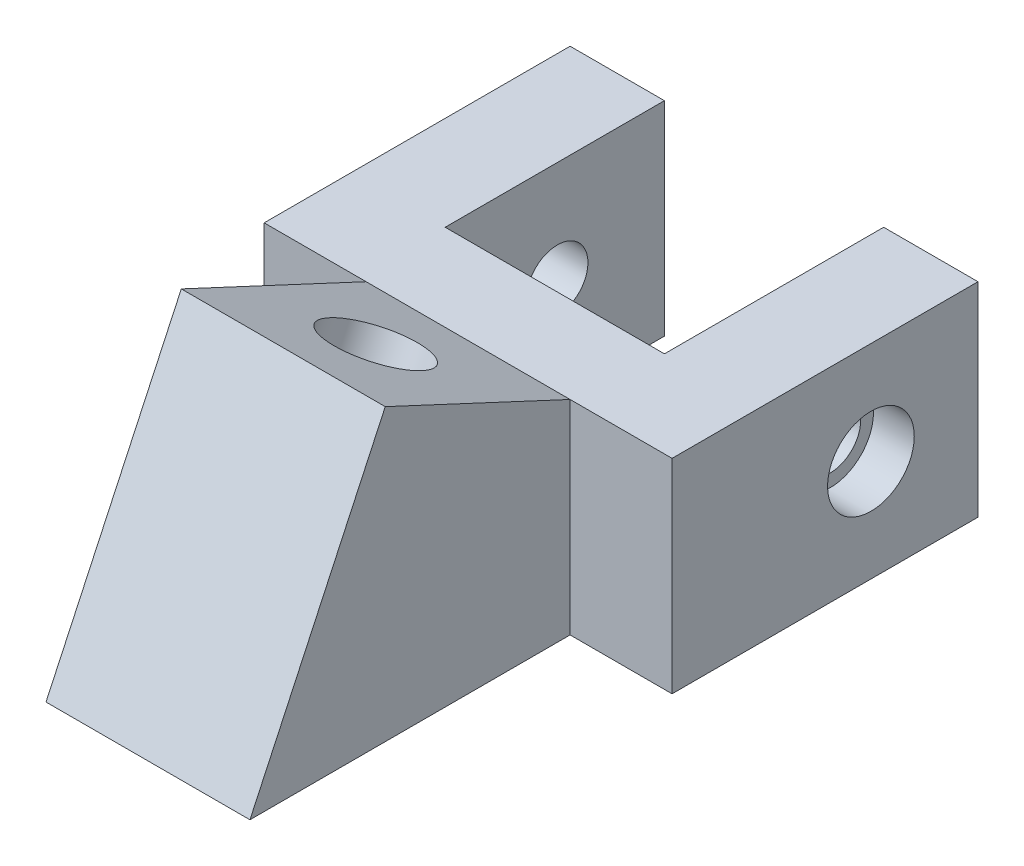
ISO-10303-21;
HEADER;
FILE_DESCRIPTION(('STEP AP214'),'2;1');
FILE_NAME('part.step','',(''),(''),'','','');
FILE_SCHEMA(('AUTOMOTIVE_DESIGN { 1 0 10303 214 1 1 1 1 }'));
ENDSEC;
DATA;
#1=APPLICATION_CONTEXT('core data for automotive mechanical design processes');
#2=APPLICATION_PROTOCOL_DEFINITION('international standard','automotive_design',2000,#1);
#3=PRODUCT_CONTEXT('',#1,'mechanical');
#4=PRODUCT('Part','Part','',(#3));
#5=PRODUCT_RELATED_PRODUCT_CATEGORY('part','',(#4));
#6=PRODUCT_DEFINITION_FORMATION('','',#4);
#7=PRODUCT_DEFINITION_CONTEXT('part definition',#1,'design');
#8=PRODUCT_DEFINITION('design','',#6,#7);
#9=PRODUCT_DEFINITION_SHAPE('','',#8);
#10=(LENGTH_UNIT() NAMED_UNIT(*) SI_UNIT(.MILLI.,.METRE.));
#11=(NAMED_UNIT(*) PLANE_ANGLE_UNIT() SI_UNIT($,.RADIAN.));
#12=(NAMED_UNIT(*) SI_UNIT($,.STERADIAN.) SOLID_ANGLE_UNIT());
#13=UNCERTAINTY_MEASURE_WITH_UNIT(LENGTH_MEASURE(1.E-05),#10,'distance_accuracy_value','');
#14=(GEOMETRIC_REPRESENTATION_CONTEXT(3) GLOBAL_UNCERTAINTY_ASSIGNED_CONTEXT((#13)) GLOBAL_UNIT_ASSIGNED_CONTEXT((#10,
#11,#12)) REPRESENTATION_CONTEXT('',''));
#15=CARTESIAN_POINT('',(0.,0.,0.));
#16=DIRECTION('',(0.,0.,1.));
#17=DIRECTION('',(1.,0.,0.));
#18=AXIS2_PLACEMENT_3D('',#15,#16,#17);
#19=CARTESIAN_POINT('',(-20.,10.,-4.5));
#20=DIRECTION('',(1.,0.,0.));
#21=DIRECTION('',(0.,0.,-1.));
#22=AXIS2_PLACEMENT_3D('',#19,#20,#21);
#23=CYLINDRICAL_SURFACE('',#22,3.);
#24=CARTESIAN_POINT('',(-10.75,10.,-4.5));
#25=DIRECTION('',(1.,0.,0.));
#26=DIRECTION('',(0.,0.,-1.));
#27=AXIS2_PLACEMENT_3D('',#24,#25,#26);
#28=CIRCLE('',#27,3.);
#29=CARTESIAN_POINT('',(-10.75,10.,-7.5));
#30=VERTEX_POINT('',#29);
#31=EDGE_CURVE('E184',#30,#30,#28,.T.);
#32=ORIENTED_EDGE('',*,*,#31,.T.);
#33=EDGE_LOOP('',(#32));
#34=FACE_BOUND('',#33,.T.);
#35=CARTESIAN_POINT('',(-16.,10.,-4.5));
#36=DIRECTION('',(-1.,0.,0.));
#37=DIRECTION('',(0.,0.,1.));
#38=AXIS2_PLACEMENT_3D('',#35,#36,#37);
#39=CIRCLE('',#38,3.);
#40=CARTESIAN_POINT('',(-16.,10.,-1.49999999999999));
#41=VERTEX_POINT('',#40);
#42=EDGE_CURVE('E37',#41,#41,#39,.F.);
#43=ORIENTED_EDGE('',*,*,#42,.F.);
#44=EDGE_LOOP('',(#43));
#45=FACE_BOUND('',#44,.T.);
#46=ADVANCED_FACE('F33',(#34,#45),#23,.F.);
#47=CARTESIAN_POINT('',(10.75,10.,-4.5));
#48=DIRECTION('',(-1.,0.,0.));
#49=DIRECTION('',(0.,0.,1.));
#50=AXIS2_PLACEMENT_3D('',#47,#48,#49);
#51=CIRCLE('',#50,3.);
#52=CARTESIAN_POINT('',(10.75,10.,-1.49999999999999));
#53=VERTEX_POINT('',#52);
#54=EDGE_CURVE('E187',#53,#53,#51,.T.);
#55=ORIENTED_EDGE('',*,*,#54,.T.);
#56=EDGE_LOOP('',(#55));
#57=FACE_BOUND('',#56,.T.);
#58=CARTESIAN_POINT('',(16.,10.,-4.5));
#59=DIRECTION('',(1.,0.,0.));
#60=DIRECTION('',(0.,0.,-1.));
#61=AXIS2_PLACEMENT_3D('',#58,#59,#60);
#62=CIRCLE('',#61,3.);
#63=CARTESIAN_POINT('',(16.,10.,-7.5));
#64=VERTEX_POINT('',#63);
#65=EDGE_CURVE('E316',#64,#64,#62,.F.);
#66=ORIENTED_EDGE('',*,*,#65,.F.);
#67=EDGE_LOOP('',(#66));
#68=FACE_BOUND('',#67,.T.);
#69=ADVANCED_FACE('F341',(#57,#68),#23,.F.);
#70=CARTESIAN_POINT('',(-20.,20.,15.));
#71=DIRECTION('',(0.,0.,-1.));
#72=DIRECTION('',(-1.,0.,0.));
#73=AXIS2_PLACEMENT_3D('',#70,#71,#72);
#74=PLANE('',#73);
#75=DIRECTION('',(0.,-1.,0.));
#76=VECTOR('',#75,1.);
#77=CARTESIAN_POINT('',(-10.,20.,15.));
#78=LINE('',#77,#76);
#79=CARTESIAN_POINT('',(-10.,20.,15.));
#80=VERTEX_POINT('',#79);
#81=CARTESIAN_POINT('',(-10.,0.,15.));
#82=VERTEX_POINT('',#81);
#83=EDGE_CURVE('E211',#80,#82,#78,.T.);
#84=ORIENTED_EDGE('',*,*,#83,.F.);
#85=DIRECTION('',(1.,0.,0.));
#86=VECTOR('',#85,1.);
#87=CARTESIAN_POINT('',(-20.,20.,15.));
#88=LINE('',#87,#86);
#89=CARTESIAN_POINT('',(-20.,20.,15.));
#90=VERTEX_POINT('',#89);
#91=EDGE_CURVE('E252',#90,#80,#88,.T.);
#92=ORIENTED_EDGE('',*,*,#91,.F.);
#93=DIRECTION('',(0.,-1.,0.));
#94=VECTOR('',#93,1.);
#95=CARTESIAN_POINT('',(-20.,20.,15.));
#96=LINE('',#95,#94);
#97=CARTESIAN_POINT('',(-20.,0.,15.));
#98=VERTEX_POINT('',#97);
#99=EDGE_CURVE('E289',#90,#98,#96,.T.);
#100=ORIENTED_EDGE('',*,*,#99,.T.);
#101=DIRECTION('',(1.,0.,0.));
#102=VECTOR('',#101,1.);
#103=CARTESIAN_POINT('',(-20.,0.,15.));
#104=LINE('',#103,#102);
#105=EDGE_CURVE('E277',#98,#82,#104,.T.);
#106=ORIENTED_EDGE('',*,*,#105,.T.);
#107=EDGE_LOOP('',(#84,#92,#100,#106));
#108=FACE_BOUND('',#107,.T.);
#109=ADVANCED_FACE('F347',(#108),#74,.F.);
#110=CARTESIAN_POINT('',(-10.75,20.,-15.));
#111=DIRECTION('',(1.,0.,0.));
#112=DIRECTION('',(0.,0.,-1.));
#113=AXIS2_PLACEMENT_3D('',#110,#111,#112);
#114=PLANE('',#113);
#115=ORIENTED_EDGE('',*,*,#31,.F.);
#116=EDGE_LOOP('',(#115));
#117=FACE_BOUND('',#116,.T.);
#118=DIRECTION('',(0.,0.,1.));
#119=VECTOR('',#118,1.);
#120=CARTESIAN_POINT('',(-10.75,0.,-15.));
#121=LINE('',#120,#119);
#122=CARTESIAN_POINT('',(-10.75,0.,-15.));
#123=VERTEX_POINT('',#122);
#124=CARTESIAN_POINT('',(-10.75,0.,6.5));
#125=VERTEX_POINT('',#124);
#126=EDGE_CURVE('E230',#123,#125,#121,.T.);
#127=ORIENTED_EDGE('',*,*,#126,.F.);
#128=DIRECTION('',(0.,-1.,0.));
#129=VECTOR('',#128,1.);
#130=CARTESIAN_POINT('',(-10.75,20.,-15.));
#131=LINE('',#130,#129);
#132=CARTESIAN_POINT('',(-10.75,20.,-15.));
#133=VERTEX_POINT('',#132);
#134=EDGE_CURVE('E285',#133,#123,#131,.T.);
#135=ORIENTED_EDGE('',*,*,#134,.F.);
#136=DIRECTION('',(0.,0.,1.));
#137=VECTOR('',#136,1.);
#138=CARTESIAN_POINT('',(-10.75,20.,-15.));
#139=LINE('',#138,#137);
#140=CARTESIAN_POINT('',(-10.75,20.,6.5));
#141=VERTEX_POINT('',#140);
#142=EDGE_CURVE('E236',#133,#141,#139,.T.);
#143=ORIENTED_EDGE('',*,*,#142,.T.);
#144=DIRECTION('',(0.,-1.,0.));
#145=VECTOR('',#144,1.);
#146=CARTESIAN_POINT('',(-10.75,20.,6.5));
#147=LINE('',#146,#145);
#148=EDGE_CURVE('E261',#141,#125,#147,.T.);
#149=ORIENTED_EDGE('',*,*,#148,.T.);
#150=EDGE_LOOP('',(#127,#135,#143,#149));
#151=FACE_BOUND('',#150,.T.);
#152=ADVANCED_FACE('F35',(#117,#151),#114,.T.);
#153=CARTESIAN_POINT('',(-20.,20.,-15.));
#154=DIRECTION('',(0.,0.,-1.));
#155=DIRECTION('',(-1.,0.,0.));
#156=AXIS2_PLACEMENT_3D('',#153,#154,#155);
#157=PLANE('',#156);
#158=DIRECTION('',(1.,0.,0.));
#159=VECTOR('',#158,1.);
#160=CARTESIAN_POINT('',(-20.,0.,-15.));
#161=LINE('',#160,#159);
#162=CARTESIAN_POINT('',(-20.,0.,-15.));
#163=VERTEX_POINT('',#162);
#164=EDGE_CURVE('E240',#163,#123,#161,.T.);
#165=ORIENTED_EDGE('',*,*,#164,.F.);
#166=DIRECTION('',(0.,-1.,0.));
#167=VECTOR('',#166,1.);
#168=CARTESIAN_POINT('',(-20.,20.,-15.));
#169=LINE('',#168,#167);
#170=CARTESIAN_POINT('',(-20.,20.,-15.));
#171=VERTEX_POINT('',#170);
#172=EDGE_CURVE('E287',#171,#163,#169,.T.);
#173=ORIENTED_EDGE('',*,*,#172,.F.);
#174=DIRECTION('',(1.,0.,0.));
#175=VECTOR('',#174,1.);
#176=CARTESIAN_POINT('',(-20.,20.,-15.));
#177=LINE('',#176,#175);
#178=EDGE_CURVE('E258',#171,#133,#177,.T.);
#179=ORIENTED_EDGE('',*,*,#178,.T.);
#180=ORIENTED_EDGE('',*,*,#134,.T.);
#181=EDGE_LOOP('',(#165,#173,#179,#180));
#182=FACE_BOUND('',#181,.T.);
#183=ADVANCED_FACE('F404',(#182),#157,.T.);
#184=CARTESIAN_POINT('',(-20.,20.,15.));
#185=DIRECTION('',(-1.,0.,0.));
#186=DIRECTION('',(0.,0.,1.));
#187=AXIS2_PLACEMENT_3D('',#184,#185,#186);
#188=PLANE('',#187);
#189=CARTESIAN_POINT('',(-20.,10.,-4.5));
#190=DIRECTION('',(-1.,0.,0.));
#191=DIRECTION('',(0.,0.,1.));
#192=AXIS2_PLACEMENT_3D('',#189,#190,#191);
#193=CIRCLE('',#192,4.25);
#194=CARTESIAN_POINT('',(-20.,10.,-0.249999999999996));
#195=VERTEX_POINT('',#194);
#196=EDGE_CURVE('E328',#195,#195,#193,.T.);
#197=ORIENTED_EDGE('',*,*,#196,.F.);
#198=EDGE_LOOP('',(#197));
#199=FACE_BOUND('',#198,.T.);
#200=DIRECTION('',(0.,0.,-1.));
#201=VECTOR('',#200,1.);
#202=CARTESIAN_POINT('',(-20.,0.,15.));
#203=LINE('',#202,#201);
#204=EDGE_CURVE('E280',#98,#163,#203,.T.);
#205=ORIENTED_EDGE('',*,*,#204,.F.);
#206=ORIENTED_EDGE('',*,*,#99,.F.);
#207=DIRECTION('',(0.,0.,-1.));
#208=VECTOR('',#207,1.);
#209=CARTESIAN_POINT('',(-20.,20.,15.));
#210=LINE('',#209,#208);
#211=EDGE_CURVE('E255',#90,#171,#210,.T.);
#212=ORIENTED_EDGE('',*,*,#211,.T.);
#213=ORIENTED_EDGE('',*,*,#172,.T.);
#214=EDGE_LOOP('',(#205,#206,#212,#213));
#215=FACE_BOUND('',#214,.T.);
#216=ADVANCED_FACE('F407',(#199,#215),#188,.T.);
#217=CARTESIAN_POINT('',(10.,20.,15.));
#218=VERTEX_POINT('',#217);
#219=CARTESIAN_POINT('',(20.,20.,15.));
#220=VERTEX_POINT('',#219);
#221=EDGE_CURVE('E251',#218,#220,#88,.T.);
#222=ORIENTED_EDGE('',*,*,#221,.F.);
#223=DIRECTION('',(0.,-1.,0.));
#224=VECTOR('',#223,1.);
#225=CARTESIAN_POINT('',(10.,20.,15.));
#226=LINE('',#225,#224);
#227=CARTESIAN_POINT('',(10.,0.,15.));
#228=VERTEX_POINT('',#227);
#229=EDGE_CURVE('E212',#218,#228,#226,.T.);
#230=ORIENTED_EDGE('',*,*,#229,.T.);
#231=CARTESIAN_POINT('',(20.,0.,15.));
#232=VERTEX_POINT('',#231);
#233=EDGE_CURVE('E276',#228,#232,#104,.T.);
#234=ORIENTED_EDGE('',*,*,#233,.T.);
#235=DIRECTION('',(0.,-1.,0.));
#236=VECTOR('',#235,1.);
#237=CARTESIAN_POINT('',(20.,20.,15.));
#238=LINE('',#237,#236);
#239=EDGE_CURVE('E291',#220,#232,#238,.T.);
#240=ORIENTED_EDGE('',*,*,#239,.F.);
#241=EDGE_LOOP('',(#222,#230,#234,#240));
#242=FACE_BOUND('',#241,.T.);
#243=ADVANCED_FACE('F411',(#242),#74,.F.);
#244=CARTESIAN_POINT('',(20.,20.,15.));
#245=DIRECTION('',(-1.,0.,0.));
#246=DIRECTION('',(0.,0.,1.));
#247=AXIS2_PLACEMENT_3D('',#244,#245,#246);
#248=PLANE('',#247);
#249=CARTESIAN_POINT('',(20.,10.,-4.5));
#250=DIRECTION('',(1.,0.,0.));
#251=DIRECTION('',(0.,0.,-1.));
#252=AXIS2_PLACEMENT_3D('',#249,#250,#251);
#253=CIRCLE('',#252,4.25);
#254=CARTESIAN_POINT('',(20.,10.,-8.75));
#255=VERTEX_POINT('',#254);
#256=EDGE_CURVE('E322',#255,#255,#253,.T.);
#257=ORIENTED_EDGE('',*,*,#256,.F.);
#258=EDGE_LOOP('',(#257));
#259=FACE_BOUND('',#258,.T.);
#260=DIRECTION('',(0.,0.,-1.));
#261=VECTOR('',#260,1.);
#262=CARTESIAN_POINT('',(20.,0.,15.));
#263=LINE('',#262,#261);
#264=CARTESIAN_POINT('',(20.,0.,-15.));
#265=VERTEX_POINT('',#264);
#266=EDGE_CURVE('E273',#232,#265,#263,.T.);
#267=ORIENTED_EDGE('',*,*,#266,.T.);
#268=DIRECTION('',(0.,-1.,0.));
#269=VECTOR('',#268,1.);
#270=CARTESIAN_POINT('',(20.,20.,-15.));
#271=LINE('',#270,#269);
#272=CARTESIAN_POINT('',(20.,20.,-15.));
#273=VERTEX_POINT('',#272);
#274=EDGE_CURVE('E294',#273,#265,#271,.T.);
#275=ORIENTED_EDGE('',*,*,#274,.F.);
#276=DIRECTION('',(0.,0.,-1.));
#277=VECTOR('',#276,1.);
#278=CARTESIAN_POINT('',(20.,20.,15.));
#279=LINE('',#278,#277);
#280=EDGE_CURVE('E249',#220,#273,#279,.T.);
#281=ORIENTED_EDGE('',*,*,#280,.F.);
#282=ORIENTED_EDGE('',*,*,#239,.T.);
#283=EDGE_LOOP('',(#267,#275,#281,#282));
#284=FACE_BOUND('',#283,.T.);
#285=ADVANCED_FACE('F415',(#259,#284),#248,.F.);
#286=CARTESIAN_POINT('',(10.75,20.,-15.));
#287=DIRECTION('',(0.,0.,-1.));
#288=DIRECTION('',(-1.,0.,0.));
#289=AXIS2_PLACEMENT_3D('',#286,#287,#288);
#290=PLANE('',#289);
#291=DIRECTION('',(1.,0.,0.));
#292=VECTOR('',#291,1.);
#293=CARTESIAN_POINT('',(10.75,0.,-15.));
#294=LINE('',#293,#292);
#295=CARTESIAN_POINT('',(10.75,0.,-15.));
#296=VERTEX_POINT('',#295);
#297=EDGE_CURVE('E270',#296,#265,#294,.T.);
#298=ORIENTED_EDGE('',*,*,#297,.F.);
#299=DIRECTION('',(0.,-1.,0.));
#300=VECTOR('',#299,1.);
#301=CARTESIAN_POINT('',(10.75,20.,-15.));
#302=LINE('',#301,#300);
#303=CARTESIAN_POINT('',(10.75,20.,-15.));
#304=VERTEX_POINT('',#303);
#305=EDGE_CURVE('E296',#304,#296,#302,.T.);
#306=ORIENTED_EDGE('',*,*,#305,.F.);
#307=DIRECTION('',(1.,0.,0.));
#308=VECTOR('',#307,1.);
#309=CARTESIAN_POINT('',(10.75,20.,-15.));
#310=LINE('',#309,#308);
#311=EDGE_CURVE('E246',#304,#273,#310,.T.);
#312=ORIENTED_EDGE('',*,*,#311,.T.);
#313=ORIENTED_EDGE('',*,*,#274,.T.);
#314=EDGE_LOOP('',(#298,#306,#312,#313));
#315=FACE_BOUND('',#314,.T.);
#316=ADVANCED_FACE('F419',(#315),#290,.T.);
#317=CARTESIAN_POINT('',(10.75,20.,6.5));
#318=DIRECTION('',(-1.,0.,0.));
#319=DIRECTION('',(0.,0.,1.));
#320=AXIS2_PLACEMENT_3D('',#317,#318,#319);
#321=PLANE('',#320);
#322=ORIENTED_EDGE('',*,*,#54,.F.);
#323=EDGE_LOOP('',(#322));
#324=FACE_BOUND('',#323,.T.);
#325=DIRECTION('',(0.,0.,-1.));
#326=VECTOR('',#325,1.);
#327=CARTESIAN_POINT('',(10.75,0.,6.5));
#328=LINE('',#327,#326);
#329=CARTESIAN_POINT('',(10.75,0.,6.5));
#330=VERTEX_POINT('',#329);
#331=EDGE_CURVE('E267',#330,#296,#328,.T.);
#332=ORIENTED_EDGE('',*,*,#331,.F.);
#333=DIRECTION('',(0.,-1.,0.));
#334=VECTOR('',#333,1.);
#335=CARTESIAN_POINT('',(10.75,20.,6.5));
#336=LINE('',#335,#334);
#337=CARTESIAN_POINT('',(10.75,20.,6.5));
#338=VERTEX_POINT('',#337);
#339=EDGE_CURVE('E298',#338,#330,#336,.T.);
#340=ORIENTED_EDGE('',*,*,#339,.F.);
#341=DIRECTION('',(0.,0.,-1.));
#342=VECTOR('',#341,1.);
#343=CARTESIAN_POINT('',(10.75,20.,6.5));
#344=LINE('',#343,#342);
#345=EDGE_CURVE('E243',#338,#304,#344,.T.);
#346=ORIENTED_EDGE('',*,*,#345,.T.);
#347=ORIENTED_EDGE('',*,*,#305,.T.);
#348=EDGE_LOOP('',(#332,#340,#346,#347));
#349=FACE_BOUND('',#348,.T.);
#350=ADVANCED_FACE('F423',(#324,#349),#321,.T.);
#351=CARTESIAN_POINT('',(-10.75,20.,6.5));
#352=DIRECTION('',(0.,0.,-1.));
#353=DIRECTION('',(-1.,0.,0.));
#354=AXIS2_PLACEMENT_3D('',#351,#352,#353);
#355=PLANE('',#354);
#356=DIRECTION('',(1.,0.,0.));
#357=VECTOR('',#356,1.);
#358=CARTESIAN_POINT('',(-10.75,0.,6.5));
#359=LINE('',#358,#357);
#360=EDGE_CURVE('E264',#125,#330,#359,.T.);
#361=ORIENTED_EDGE('',*,*,#360,.F.);
#362=ORIENTED_EDGE('',*,*,#148,.F.);
#363=DIRECTION('',(1.,0.,0.));
#364=VECTOR('',#363,1.);
#365=CARTESIAN_POINT('',(-10.75,20.,6.5));
#366=LINE('',#365,#364);
#367=EDGE_CURVE('E239',#141,#338,#366,.T.);
#368=ORIENTED_EDGE('',*,*,#367,.T.);
#369=ORIENTED_EDGE('',*,*,#339,.T.);
#370=EDGE_LOOP('',(#361,#362,#368,#369));
#371=FACE_BOUND('',#370,.T.);
#372=ADVANCED_FACE('F399',(#371),#355,.T.);
#373=CARTESIAN_POINT('',(0.,20.,0.));
#374=DIRECTION('',(0.,1.,0.));
#375=DIRECTION('',(0.,0.,1.));
#376=AXIS2_PLACEMENT_3D('',#373,#374,#375);
#377=PLANE('',#376);
#378=ORIENTED_EDGE('',*,*,#142,.F.);
#379=ORIENTED_EDGE('',*,*,#178,.F.);
#380=ORIENTED_EDGE('',*,*,#211,.F.);
#381=ORIENTED_EDGE('',*,*,#91,.T.);
#382=DIRECTION('',(-1.,0.,0.));
#383=VECTOR('',#382,1.);
#384=CARTESIAN_POINT('',(10.,20.,15.));
#385=LINE('',#384,#383);
#386=EDGE_CURVE('E228',#218,#80,#385,.T.);
#387=ORIENTED_EDGE('',*,*,#386,.F.);
#388=ORIENTED_EDGE('',*,*,#221,.T.);
#389=ORIENTED_EDGE('',*,*,#280,.T.);
#390=ORIENTED_EDGE('',*,*,#311,.F.);
#391=ORIENTED_EDGE('',*,*,#345,.F.);
#392=ORIENTED_EDGE('',*,*,#367,.F.);
#393=EDGE_LOOP('',(#378,#379,#380,#381,#387,#388,#389,#390,#391,#392));
#394=FACE_BOUND('',#393,.T.);
#395=ADVANCED_FACE('F396',(#394),#377,.T.);
#396=CARTESIAN_POINT('',(0.,0.,0.));
#397=DIRECTION('',(0.,1.,0.));
#398=DIRECTION('',(0.,0.,1.));
#399=AXIS2_PLACEMENT_3D('',#396,#397,#398);
#400=PLANE('',#399);
#401=DIRECTION('',(0.463622830290399,0.,0.88603265810777));
#402=VECTOR('',#401,1.);
#403=CARTESIAN_POINT('',(-20.8708435984897,0.,10.9208159441264));
#404=LINE('',#403,#402);
#405=CARTESIAN_POINT('',(-8.08290376865475,0.,35.3599323527247));
#406=VERTEX_POINT('',#405);
#407=CARTESIAN_POINT('',(-4.04145188432738,0.,43.0835777854621));
#408=VERTEX_POINT('',#407);
#409=EDGE_CURVE('E42',#406,#408,#404,.T.);
#410=ORIENTED_EDGE('',*,*,#409,.T.);
#411=DIRECTION('',(1.,0.,0.));
#412=VECTOR('',#411,1.);
#413=CARTESIAN_POINT('',(0.,0.,43.0835777854621));
#414=LINE('',#413,#412);
#415=CARTESIAN_POINT('',(4.04145188432737,0.,43.0835777854622));
#416=VERTEX_POINT('',#415);
#417=EDGE_CURVE('E11',#408,#416,#414,.T.);
#418=ORIENTED_EDGE('',*,*,#417,.T.);
#419=DIRECTION('',(0.4636228302904,0.,-0.886032658107769));
#420=VECTOR('',#419,1.);
#421=CARTESIAN_POINT('',(20.8708435984897,0.,10.9208159441265));
#422=LINE('',#421,#420);
#423=CARTESIAN_POINT('',(8.08290376865476,0.,35.3599323527247));
#424=VERTEX_POINT('',#423);
#425=EDGE_CURVE('E164',#416,#424,#422,.T.);
#426=ORIENTED_EDGE('',*,*,#425,.T.);
#427=DIRECTION('',(-0.4636228302904,0.,-0.886032658107769));
#428=VECTOR('',#427,1.);
#429=CARTESIAN_POINT('',(-8.17981380970887,0.,4.28014520119918));
#430=LINE('',#429,#428);
#431=CARTESIAN_POINT('',(4.04145188432739,0.,27.6362869199873));
#432=VERTEX_POINT('',#431);
#433=EDGE_CURVE('E304',#424,#432,#430,.T.);
#434=ORIENTED_EDGE('',*,*,#433,.T.);
#435=DIRECTION('',(-1.,0.,0.));
#436=VECTOR('',#435,1.);
#437=CARTESIAN_POINT('',(0.,0.,27.6362869199873));
#438=LINE('',#437,#436);
#439=CARTESIAN_POINT('',(-4.04145188432738,0.,27.6362869199873));
#440=VERTEX_POINT('',#439);
#441=EDGE_CURVE('E307',#432,#440,#438,.T.);
#442=ORIENTED_EDGE('',*,*,#441,.T.);
#443=DIRECTION('',(-0.4636228302904,0.,0.886032658107769));
#444=VECTOR('',#443,1.);
#445=CARTESIAN_POINT('',(8.17981380970889,0.,4.28014520119919));
#446=LINE('',#445,#444);
#447=EDGE_CURVE('E310',#440,#406,#446,.T.);
#448=ORIENTED_EDGE('',*,*,#447,.T.);
#449=EDGE_LOOP('',(#410,#418,#426,#434,#442,#448));
#450=FACE_BOUND('',#449,.T.);
#451=ORIENTED_EDGE('',*,*,#126,.T.);
#452=ORIENTED_EDGE('',*,*,#360,.T.);
#453=ORIENTED_EDGE('',*,*,#331,.T.);
#454=ORIENTED_EDGE('',*,*,#297,.T.);
#455=ORIENTED_EDGE('',*,*,#266,.F.);
#456=ORIENTED_EDGE('',*,*,#233,.F.);
#457=DIRECTION('',(0.,0.,-1.));
#458=VECTOR('',#457,1.);
#459=CARTESIAN_POINT('',(10.,0.,46.3937115423496));
#460=LINE('',#459,#458);
#461=CARTESIAN_POINT('',(10.,0.,46.3937115423496));
#462=VERTEX_POINT('',#461);
#463=EDGE_CURVE('E58',#462,#228,#460,.T.);
#464=ORIENTED_EDGE('',*,*,#463,.F.);
#465=DIRECTION('',(-1.,0.,0.));
#466=VECTOR('',#465,1.);
#467=CARTESIAN_POINT('',(10.,0.,46.3937115423496));
#468=LINE('',#467,#466);
#469=CARTESIAN_POINT('',(-10.,0.,46.3937115423496));
#470=VERTEX_POINT('',#469);
#471=EDGE_CURVE('E220',#462,#470,#468,.T.);
#472=ORIENTED_EDGE('',*,*,#471,.T.);
#473=DIRECTION('',(0.,0.,-1.));
#474=VECTOR('',#473,1.);
#475=CARTESIAN_POINT('',(-10.,0.,46.3937115423496));
#476=LINE('',#475,#474);
#477=EDGE_CURVE('E223',#470,#82,#476,.T.);
#478=ORIENTED_EDGE('',*,*,#477,.T.);
#479=ORIENTED_EDGE('',*,*,#105,.F.);
#480=ORIENTED_EDGE('',*,*,#204,.T.);
#481=ORIENTED_EDGE('',*,*,#164,.T.);
#482=EDGE_LOOP('',(#451,#452,#453,#454,#455,#456,#464,#472,#478,#479,#480,#481));
#483=FACE_BOUND('',#482,.T.);
#484=ADVANCED_FACE('F391',(#450,#483),#400,.F.);
#485=CARTESIAN_POINT('',(10.,20.,15.));
#486=DIRECTION('',(0.,-0.906307787036653,0.422618261740693));
#487=DIRECTION('',(0.,-0.422618261740693,-0.906307787036653));
#488=AXIS2_PLACEMENT_3D('',#485,#486,#487);
#489=PLANE('',#488);
#490=CARTESIAN_POINT('',(0.,24.2261826174069,24.0630778703665));
#491=DIRECTION('',(0.,0.906307787036653,-0.422618261740694));
#492=DIRECTION('',(0.,0.422618261740694,0.906307787036653));
#493=AXIS2_PLACEMENT_3D('',#490,#491,#492);
#494=CIRCLE('',#493,4.5);
#495=CARTESIAN_POINT('',(0.,26.1279647952401,28.1414629120315));
#496=VERTEX_POINT('',#495);
#497=EDGE_CURVE('E208',#496,#496,#494,.T.);
#498=ORIENTED_EDGE('',*,*,#497,.F.);
#499=EDGE_LOOP('',(#498));
#500=FACE_BOUND('',#499,.T.);
#501=DIRECTION('',(0.,0.422618261740693,0.906307787036653));
#502=VECTOR('',#501,1.);
#503=CARTESIAN_POINT('',(-10.,20.,15.));
#504=LINE('',#503,#502);
#505=CARTESIAN_POINT('',(-10.,28.4523652348139,33.1261557407331));
#506=VERTEX_POINT('',#505);
#507=EDGE_CURVE('E214',#80,#506,#504,.T.);
#508=ORIENTED_EDGE('',*,*,#507,.T.);
#509=DIRECTION('',(-1.,0.,0.));
#510=VECTOR('',#509,1.);
#511=CARTESIAN_POINT('',(10.,28.4523652348139,33.1261557407331));
#512=LINE('',#511,#510);
#513=CARTESIAN_POINT('',(10.,28.4523652348139,33.1261557407331));
#514=VERTEX_POINT('',#513);
#515=EDGE_CURVE('E231',#514,#506,#512,.T.);
#516=ORIENTED_EDGE('',*,*,#515,.F.);
#517=DIRECTION('',(0.,0.422618261740693,0.906307787036653));
#518=VECTOR('',#517,1.);
#519=CARTESIAN_POINT('',(10.,20.,15.));
#520=LINE('',#519,#518);
#521=EDGE_CURVE('E218',#218,#514,#520,.T.);
#522=ORIENTED_EDGE('',*,*,#521,.F.);
#523=ORIENTED_EDGE('',*,*,#386,.T.);
#524=EDGE_LOOP('',(#508,#516,#522,#523));
#525=FACE_BOUND('',#524,.T.);
#526=ADVANCED_FACE('F388',(#500,#525),#489,.F.);
#527=CARTESIAN_POINT('',(10.,28.4523652348139,33.1261557407331));
#528=DIRECTION('',(0.,-0.422618261740693,-0.906307787036653));
#529=DIRECTION('',(0.,0.906307787036653,-0.422618261740693));
#530=AXIS2_PLACEMENT_3D('',#527,#528,#529);
#531=PLANE('',#530);
#532=DIRECTION('',(0.,-0.906307787036653,0.422618261740693));
#533=VECTOR('',#532,1.);
#534=CARTESIAN_POINT('',(-10.,28.4523652348139,33.1261557407331));
#535=LINE('',#534,#533);
#536=EDGE_CURVE('E225',#506,#470,#535,.T.);
#537=ORIENTED_EDGE('',*,*,#536,.T.);
#538=ORIENTED_EDGE('',*,*,#471,.F.);
#539=DIRECTION('',(0.,-0.906307787036653,0.422618261740693));
#540=VECTOR('',#539,1.);
#541=CARTESIAN_POINT('',(10.,28.4523652348139,33.1261557407331));
#542=LINE('',#541,#540);
#543=EDGE_CURVE('E216',#514,#462,#542,.T.);
#544=ORIENTED_EDGE('',*,*,#543,.F.);
#545=ORIENTED_EDGE('',*,*,#515,.T.);
#546=EDGE_LOOP('',(#537,#538,#544,#545));
#547=FACE_BOUND('',#546,.T.);
#548=ADVANCED_FACE('F384',(#547),#531,.F.);
#549=CARTESIAN_POINT('',(10.,0.,0.));
#550=DIRECTION('',(1.,0.,0.));
#551=DIRECTION('',(0.,0.,-1.));
#552=AXIS2_PLACEMENT_3D('',#549,#550,#551);
#553=PLANE('',#552);
#554=ORIENTED_EDGE('',*,*,#229,.F.);
#555=ORIENTED_EDGE('',*,*,#521,.T.);
#556=ORIENTED_EDGE('',*,*,#543,.T.);
#557=ORIENTED_EDGE('',*,*,#463,.T.);
#558=EDGE_LOOP('',(#554,#555,#556,#557));
#559=FACE_BOUND('',#558,.T.);
#560=ADVANCED_FACE('F381',(#559),#553,.T.);
#561=CARTESIAN_POINT('',(-10.,0.,0.));
#562=DIRECTION('',(1.,0.,0.));
#563=DIRECTION('',(0.,0.,-1.));
#564=AXIS2_PLACEMENT_3D('',#561,#562,#563);
#565=PLANE('',#564);
#566=ORIENTED_EDGE('',*,*,#83,.T.);
#567=ORIENTED_EDGE('',*,*,#477,.F.);
#568=ORIENTED_EDGE('',*,*,#536,.F.);
#569=ORIENTED_EDGE('',*,*,#507,.F.);
#570=EDGE_LOOP('',(#566,#567,#568,#569));
#571=FACE_BOUND('',#570,.T.);
#572=ADVANCED_FACE('F379',(#571),#565,.F.);
#573=CARTESIAN_POINT('',(0.,-4.22618261740693,37.3306336719831));
#574=DIRECTION('',(0.,0.906307787036653,-0.422618261740693));
#575=DIRECTION('',(0.,0.422618261740694,0.906307787036653));
#576=AXIS2_PLACEMENT_3D('',#573,#574,#575);
#577=CYLINDRICAL_SURFACE('',#576,4.5);
#578=CARTESIAN_POINT('',(0.,3.38110351556392,33.7832978904025));
#579=DIRECTION('',(0.,0.906307787036653,-0.422618261740693));
#580=DIRECTION('',(0.,0.422618261740693,0.906307787036653));
#581=AXIS2_PLACEMENT_3D('',#578,#579,#580);
#582=CIRCLE('',#581,4.5);
#583=CARTESIAN_POINT('',(0.,5.28288569339704,37.8616829320674));
#584=VERTEX_POINT('',#583);
#585=EDGE_CURVE('E200',#584,#584,#582,.F.);
#586=ORIENTED_EDGE('',*,*,#585,.T.);
#587=EDGE_LOOP('',(#586));
#588=FACE_BOUND('',#587,.T.);
#589=ORIENTED_EDGE('',*,*,#497,.T.);
#590=EDGE_LOOP('',(#589));
#591=FACE_BOUND('',#590,.T.);
#592=ADVANCED_FACE('F376',(#588,#591),#577,.F.);
#593=CARTESIAN_POINT('',(-4.04145188432738,-11.7867243929843,48.5798176344729));
#594=DIRECTION('',(0.,0.422618261740693,0.906307787036653));
#595=DIRECTION('',(0.,-0.906307787036653,0.422618261740693));
#596=AXIS2_PLACEMENT_3D('',#593,#594,#595);
#597=PLANE('',#596);
#598=DIRECTION('',(0.,0.906307787036653,-0.422618261740693));
#599=VECTOR('',#598,1.);
#600=CARTESIAN_POINT('',(-4.04145188432738,-11.7867243929843,48.5798176344729));
#601=LINE('',#600,#599);
#602=CARTESIAN_POINT('',(-4.04145188432738,6.33943134774878,40.1274523996591));
#603=VERTEX_POINT('',#602);
#604=EDGE_CURVE('E183',#408,#603,#601,.T.);
#605=ORIENTED_EDGE('',*,*,#604,.T.);
#606=DIRECTION('',(1.,0.,0.));
#607=VECTOR('',#606,1.);
#608=CARTESIAN_POINT('',(-4.04145188432738,6.33943134774878,40.1274523996591));
#609=LINE('',#608,#607);
#610=CARTESIAN_POINT('',(4.04145188432737,6.33943134774878,40.1274523996591));
#611=VERTEX_POINT('',#610);
#612=EDGE_CURVE('E175',#603,#611,#609,.T.);
#613=ORIENTED_EDGE('',*,*,#612,.T.);
#614=DIRECTION('',(0.,0.906307787036653,-0.422618261740693));
#615=VECTOR('',#614,1.);
#616=CARTESIAN_POINT('',(4.04145188432737,-11.7867243929843,48.5798176344729));
#617=LINE('',#616,#615);
#618=EDGE_CURVE('E159',#416,#611,#617,.T.);
#619=ORIENTED_EDGE('',*,*,#618,.F.);
#620=ORIENTED_EDGE('',*,*,#417,.F.);
#621=EDGE_LOOP('',(#605,#613,#619,#620));
#622=FACE_BOUND('',#621,.T.);
#623=ADVANCED_FACE('F181',(#622),#597,.F.);
#624=CARTESIAN_POINT('',(-8.08290376865475,-14.7450522251691,42.2356631252164));
#625=DIRECTION('',(-0.866025403784439,0.211309130870346,0.453153893518326));
#626=DIRECTION('',(0.463622830290399,0.,0.88603265810777));
#627=AXIS2_PLACEMENT_3D('',#624,#625,#626);
#628=PLANE('',#627);
#629=DIRECTION('',(0.,0.906307787036653,-0.422618261740693));
#630=VECTOR('',#629,1.);
#631=CARTESIAN_POINT('',(-8.08290376865475,-14.7450522251691,42.2356631252164));
#632=LINE('',#631,#630);
#633=CARTESIAN_POINT('',(-8.08290376865475,3.38110351556393,33.7832978904025));
#634=VERTEX_POINT('',#633);
#635=EDGE_CURVE('E201',#406,#634,#632,.T.);
#636=ORIENTED_EDGE('',*,*,#635,.T.);
#637=DIRECTION('',(0.5,0.365998150770661,0.784885567221399));
#638=VECTOR('',#637,1.);
#639=CARTESIAN_POINT('',(-8.08290376865475,3.38110351556393,33.7832978904025));
#640=LINE('',#639,#638);
#641=EDGE_CURVE('E167',#634,#603,#640,.T.);
#642=ORIENTED_EDGE('',*,*,#641,.T.);
#643=ORIENTED_EDGE('',*,*,#604,.F.);
#644=ORIENTED_EDGE('',*,*,#409,.F.);
#645=EDGE_LOOP('',(#636,#642,#643,#644));
#646=FACE_BOUND('',#645,.T.);
#647=ADVANCED_FACE('F356',(#646),#628,.F.);
#648=CARTESIAN_POINT('',(-4.04145188432738,-17.703380057354,35.8915086159598));
#649=DIRECTION('',(-0.866025403784439,-0.211309130870347,-0.453153893518327));
#650=DIRECTION('',(-0.4636228302904,0.,0.886032658107769));
#651=AXIS2_PLACEMENT_3D('',#648,#649,#650);
#652=PLANE('',#651);
#653=DIRECTION('',(0.,0.906307787036653,-0.422618261740693));
#654=VECTOR('',#653,1.);
#655=CARTESIAN_POINT('',(-4.04145188432738,-17.703380057354,35.8915086159598));
#656=LINE('',#655,#654);
#657=CARTESIAN_POINT('',(-4.04145188432738,0.422775683379079,27.4391433811459));
#658=VERTEX_POINT('',#657);
#659=EDGE_CURVE('E203',#440,#658,#656,.T.);
#660=ORIENTED_EDGE('',*,*,#659,.T.);
#661=DIRECTION('',(-0.5,0.365998150770661,0.784885567221398));
#662=VECTOR('',#661,1.);
#663=CARTESIAN_POINT('',(-4.04145188432738,0.422775683379079,27.4391433811459));
#664=LINE('',#663,#662);
#665=EDGE_CURVE('E195',#658,#634,#664,.T.);
#666=ORIENTED_EDGE('',*,*,#665,.T.);
#667=ORIENTED_EDGE('',*,*,#635,.F.);
#668=ORIENTED_EDGE('',*,*,#447,.F.);
#669=EDGE_LOOP('',(#660,#666,#667,#668));
#670=FACE_BOUND('',#669,.T.);
#671=ADVANCED_FACE('F359',(#670),#652,.F.);
#672=CARTESIAN_POINT('',(4.04145188432738,-17.703380057354,35.8915086159598));
#673=DIRECTION('',(0.,-0.422618261740693,-0.906307787036653));
#674=DIRECTION('',(0.,0.906307787036653,-0.422618261740693));
#675=AXIS2_PLACEMENT_3D('',#672,#673,#674);
#676=PLANE('',#675);
#677=DIRECTION('',(0.,0.906307787036653,-0.422618261740693));
#678=VECTOR('',#677,1.);
#679=CARTESIAN_POINT('',(4.04145188432738,-17.703380057354,35.8915086159598));
#680=LINE('',#679,#678);
#681=CARTESIAN_POINT('',(4.04145188432738,0.422775683379081,27.4391433811459));
#682=VERTEX_POINT('',#681);
#683=EDGE_CURVE('E205',#432,#682,#680,.T.);
#684=ORIENTED_EDGE('',*,*,#683,.T.);
#685=DIRECTION('',(-1.,0.,0.));
#686=VECTOR('',#685,1.);
#687=CARTESIAN_POINT('',(4.04145188432738,0.422775683379081,27.4391433811459));
#688=LINE('',#687,#686);
#689=EDGE_CURVE('E192',#682,#658,#688,.T.);
#690=ORIENTED_EDGE('',*,*,#689,.T.);
#691=ORIENTED_EDGE('',*,*,#659,.F.);
#692=ORIENTED_EDGE('',*,*,#441,.F.);
#693=EDGE_LOOP('',(#684,#690,#691,#692));
#694=FACE_BOUND('',#693,.T.);
#695=ADVANCED_FACE('F363',(#694),#676,.F.);
#696=CARTESIAN_POINT('',(8.08290376865476,-14.7450522251691,42.2356631252164));
#697=DIRECTION('',(0.866025403784439,-0.211309130870346,-0.453153893518326));
#698=DIRECTION('',(-0.4636228302904,0.,-0.886032658107769));
#699=AXIS2_PLACEMENT_3D('',#696,#697,#698);
#700=PLANE('',#699);
#701=DIRECTION('',(0.,0.906307787036653,-0.422618261740693));
#702=VECTOR('',#701,1.);
#703=CARTESIAN_POINT('',(8.08290376865476,-14.7450522251691,42.2356631252164));
#704=LINE('',#703,#702);
#705=CARTESIAN_POINT('',(8.08290376865476,3.38110351556393,33.7832978904025));
#706=VERTEX_POINT('',#705);
#707=EDGE_CURVE('E50',#424,#706,#704,.T.);
#708=ORIENTED_EDGE('',*,*,#707,.T.);
#709=DIRECTION('',(-0.5,-0.365998150770662,-0.784885567221398));
#710=VECTOR('',#709,1.);
#711=CARTESIAN_POINT('',(8.08290376865476,3.38110351556393,33.7832978904025));
#712=LINE('',#711,#710);
#713=EDGE_CURVE('E179',#706,#682,#712,.T.);
#714=ORIENTED_EDGE('',*,*,#713,.T.);
#715=ORIENTED_EDGE('',*,*,#683,.F.);
#716=ORIENTED_EDGE('',*,*,#433,.F.);
#717=EDGE_LOOP('',(#708,#714,#715,#716));
#718=FACE_BOUND('',#717,.T.);
#719=ADVANCED_FACE('F367',(#718),#700,.F.);
#720=CARTESIAN_POINT('',(4.04145188432737,-11.7867243929843,48.5798176344729));
#721=DIRECTION('',(0.866025403784438,0.211309130870347,0.453153893518327));
#722=DIRECTION('',(0.4636228302904,0.,-0.886032658107769));
#723=AXIS2_PLACEMENT_3D('',#720,#721,#722);
#724=PLANE('',#723);
#725=ORIENTED_EDGE('',*,*,#618,.T.);
#726=DIRECTION('',(0.5,-0.365998150770661,-0.784885567221398));
#727=VECTOR('',#726,1.);
#728=CARTESIAN_POINT('',(4.04145188432737,6.33943134774878,40.1274523996591));
#729=LINE('',#728,#727);
#730=EDGE_CURVE('E162',#611,#706,#729,.T.);
#731=ORIENTED_EDGE('',*,*,#730,.T.);
#732=ORIENTED_EDGE('',*,*,#707,.F.);
#733=ORIENTED_EDGE('',*,*,#425,.F.);
#734=EDGE_LOOP('',(#725,#731,#732,#733));
#735=FACE_BOUND('',#734,.T.);
#736=ADVANCED_FACE('F161',(#735),#724,.F.);
#737=CARTESIAN_POINT('',(0.,-10.1625363283698,4.73886851619712));
#738=DIRECTION('',(0.,0.906307787036653,-0.422618261740693));
#739=DIRECTION('',(0.,0.422618261740693,0.906307787036653));
#740=AXIS2_PLACEMENT_3D('',#737,#738,#739);
#741=PLANE('',#740);
#742=ORIENTED_EDGE('',*,*,#612,.F.);
#743=ORIENTED_EDGE('',*,*,#641,.F.);
#744=ORIENTED_EDGE('',*,*,#665,.F.);
#745=ORIENTED_EDGE('',*,*,#689,.F.);
#746=ORIENTED_EDGE('',*,*,#713,.F.);
#747=ORIENTED_EDGE('',*,*,#730,.F.);
#748=EDGE_LOOP('',(#742,#743,#744,#745,#746,#747));
#749=FACE_BOUND('',#748,.T.);
#750=ORIENTED_EDGE('',*,*,#585,.F.);
#751=EDGE_LOOP('',(#750));
#752=FACE_BOUND('',#751,.T.);
#753=ADVANCED_FACE('F172',(#749,#752),#741,.F.);
#754=CARTESIAN_POINT('',(16.,10.,-4.5));
#755=DIRECTION('',(1.,0.,0.));
#756=DIRECTION('',(0.,0.,-1.));
#757=AXIS2_PLACEMENT_3D('',#754,#755,#756);
#758=PLANE('',#757);
#759=CARTESIAN_POINT('',(16.,10.,-4.5));
#760=DIRECTION('',(1.,0.,0.));
#761=DIRECTION('',(0.,0.,-1.));
#762=AXIS2_PLACEMENT_3D('',#759,#760,#761);
#763=CIRCLE('',#762,4.25);
#764=CARTESIAN_POINT('',(16.,10.,-8.75));
#765=VERTEX_POINT('',#764);
#766=EDGE_CURVE('E318',#765,#765,#763,.T.);
#767=ORIENTED_EDGE('',*,*,#766,.T.);
#768=EDGE_LOOP('',(#767));
#769=FACE_BOUND('',#768,.T.);
#770=ORIENTED_EDGE('',*,*,#65,.T.);
#771=EDGE_LOOP('',(#770));
#772=FACE_BOUND('',#771,.T.);
#773=ADVANCED_FACE('F355',(#769,#772),#758,.T.);
#774=CARTESIAN_POINT('',(16.,10.,-4.5));
#775=DIRECTION('',(1.,0.,0.));
#776=DIRECTION('',(0.,0.,-1.));
#777=AXIS2_PLACEMENT_3D('',#774,#775,#776);
#778=CYLINDRICAL_SURFACE('',#777,4.25);
#779=ORIENTED_EDGE('',*,*,#766,.F.);
#780=EDGE_LOOP('',(#779));
#781=FACE_BOUND('',#780,.T.);
#782=ORIENTED_EDGE('',*,*,#256,.T.);
#783=EDGE_LOOP('',(#782));
#784=FACE_BOUND('',#783,.T.);
#785=ADVANCED_FACE('F351',(#781,#784),#778,.F.);
#786=CARTESIAN_POINT('',(-16.,10.,-4.5));
#787=DIRECTION('',(-1.,0.,0.));
#788=DIRECTION('',(0.,0.,1.));
#789=AXIS2_PLACEMENT_3D('',#786,#787,#788);
#790=PLANE('',#789);
#791=CARTESIAN_POINT('',(-16.,10.,-4.5));
#792=DIRECTION('',(-1.,0.,0.));
#793=DIRECTION('',(0.,0.,1.));
#794=AXIS2_PLACEMENT_3D('',#791,#792,#793);
#795=CIRCLE('',#794,4.25);
#796=CARTESIAN_POINT('',(-16.,10.,-0.249999999999996));
#797=VERTEX_POINT('',#796);
#798=EDGE_CURVE('E331',#797,#797,#795,.T.);
#799=ORIENTED_EDGE('',*,*,#798,.T.);
#800=EDGE_LOOP('',(#799));
#801=FACE_BOUND('',#800,.T.);
#802=ORIENTED_EDGE('',*,*,#42,.T.);
#803=EDGE_LOOP('',(#802));
#804=FACE_BOUND('',#803,.T.);
#805=ADVANCED_FACE('F338',(#801,#804),#790,.T.);
#806=CARTESIAN_POINT('',(-16.,10.,-4.5));
#807=DIRECTION('',(-1.,0.,0.));
#808=DIRECTION('',(0.,0.,1.));
#809=AXIS2_PLACEMENT_3D('',#806,#807,#808);
#810=CYLINDRICAL_SURFACE('',#809,4.25);
#811=ORIENTED_EDGE('',*,*,#798,.F.);
#812=EDGE_LOOP('',(#811));
#813=FACE_BOUND('',#812,.T.);
#814=ORIENTED_EDGE('',*,*,#196,.T.);
#815=EDGE_LOOP('',(#814));
#816=FACE_BOUND('',#815,.T.);
#817=ADVANCED_FACE('F538',(#813,#816),#810,.F.);
#818=CLOSED_SHELL('',(#46,#69,#109,#152,#183,#216,#243,#285,#316,#350,#372,#395,#484,#526,#548,
#560,#572,#592,#623,#647,#671,#695,#719,#736,#753,#773,#785,#805,#817));
#819=MANIFOLD_SOLID_BREP('B2',#818);
#820=ADVANCED_BREP_SHAPE_REPRESENTATION('',(#18,#819),#14);
#821=SHAPE_DEFINITION_REPRESENTATION(#9,#820);
ENDSEC;
END-ISO-10303-21;
